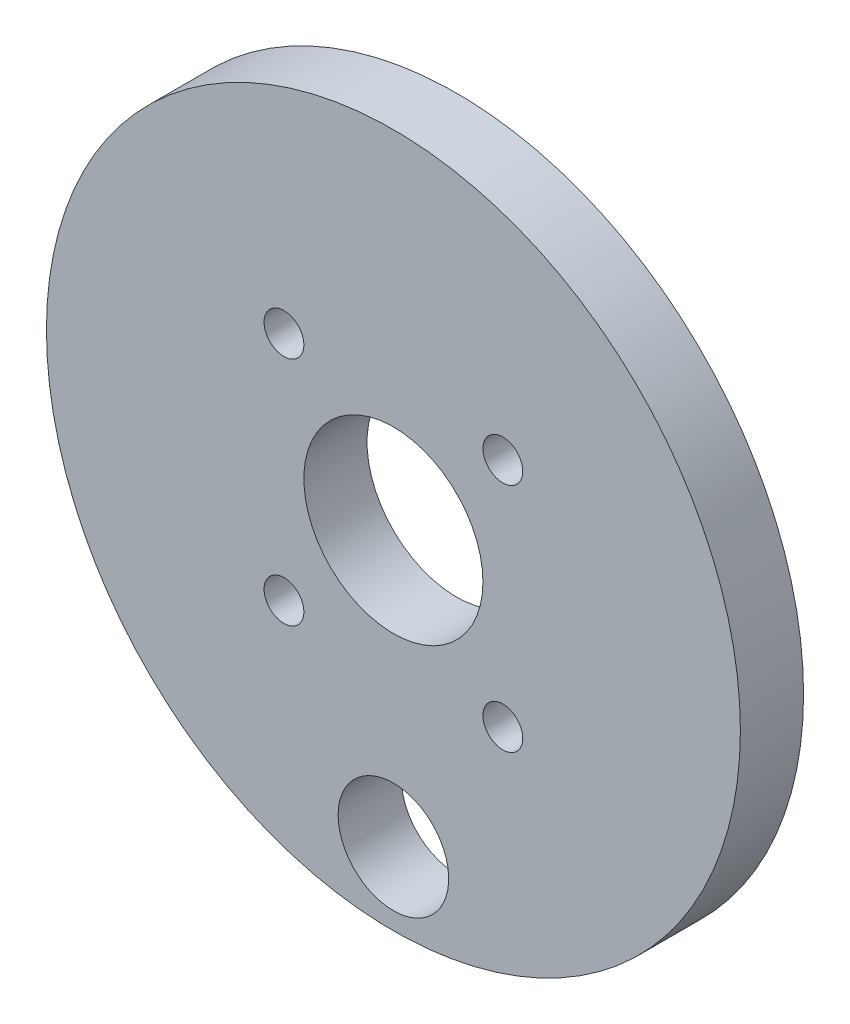
ISO-10303-21;
HEADER;
FILE_DESCRIPTION(('STEP AP214'),'2;1');
FILE_NAME('part.step','',(''),(''),'','','');
FILE_SCHEMA(('AUTOMOTIVE_DESIGN { 1 0 10303 214 1 1 1 1 }'));
ENDSEC;
DATA;
#1=APPLICATION_CONTEXT('core data for automotive mechanical design processes');
#2=APPLICATION_PROTOCOL_DEFINITION('international standard','automotive_design',2000,#1);
#3=PRODUCT_CONTEXT('',#1,'mechanical');
#4=PRODUCT('Part','Part','',(#3));
#5=PRODUCT_RELATED_PRODUCT_CATEGORY('part','',(#4));
#6=PRODUCT_DEFINITION_FORMATION('','',#4);
#7=PRODUCT_DEFINITION_CONTEXT('part definition',#1,'design');
#8=PRODUCT_DEFINITION('design','',#6,#7);
#9=PRODUCT_DEFINITION_SHAPE('','',#8);
#10=(LENGTH_UNIT() NAMED_UNIT(*) SI_UNIT(.MILLI.,.METRE.));
#11=(NAMED_UNIT(*) PLANE_ANGLE_UNIT() SI_UNIT($,.RADIAN.));
#12=(NAMED_UNIT(*) SI_UNIT($,.STERADIAN.) SOLID_ANGLE_UNIT());
#13=UNCERTAINTY_MEASURE_WITH_UNIT(LENGTH_MEASURE(1.E-05),#10,'distance_accuracy_value','');
#14=(GEOMETRIC_REPRESENTATION_CONTEXT(3) GLOBAL_UNCERTAINTY_ASSIGNED_CONTEXT((#13)) GLOBAL_UNIT_ASSIGNED_CONTEXT((#10,
#11,#12)) REPRESENTATION_CONTEXT('',''));
#15=CARTESIAN_POINT('',(0.,0.,0.));
#16=DIRECTION('',(0.,0.,1.));
#17=DIRECTION('',(1.,0.,0.));
#18=AXIS2_PLACEMENT_3D('',#15,#16,#17);
#19=CARTESIAN_POINT('',(0.,0.,6.35));
#20=DIRECTION('',(0.,0.,1.));
#21=DIRECTION('',(1.,0.,0.));
#22=AXIS2_PLACEMENT_3D('',#19,#20,#21);
#23=PLANE('',#22);
#24=CARTESIAN_POINT('',(0.,-27.5594408880053,6.35));
#25=DIRECTION('',(0.,0.,-1.));
#26=DIRECTION('',(-1.,0.,0.));
#27=AXIS2_PLACEMENT_3D('',#24,#25,#26);
#28=CIRCLE('',#27,5.55625);
#29=CARTESIAN_POINT('',(-5.55625,-27.5594408880053,6.35));
#30=VERTEX_POINT('',#29);
#31=EDGE_CURVE('E73',#30,#30,#28,.T.);
#32=ORIENTED_EDGE('',*,*,#31,.T.);
#33=EDGE_LOOP('',(#32));
#34=FACE_BOUND('',#33,.T.);
#35=CARTESIAN_POINT('',(11.0000000000004,-11.6189500386224,6.35));
#36=DIRECTION('',(0.,0.,-1.));
#37=DIRECTION('',(-1.,0.,0.));
#38=AXIS2_PLACEMENT_3D('',#35,#36,#37);
#39=CIRCLE('',#38,2.);
#40=CARTESIAN_POINT('',(9.00000000000039,-11.6189500386224,6.35));
#41=VERTEX_POINT('',#40);
#42=EDGE_CURVE('E67',#41,#41,#39,.T.);
#43=ORIENTED_EDGE('',*,*,#42,.T.);
#44=EDGE_LOOP('',(#43));
#45=FACE_BOUND('',#44,.T.);
#46=CARTESIAN_POINT('',(-10.9999999999996,-11.6189500386224,6.35));
#47=DIRECTION('',(0.,0.,-1.));
#48=DIRECTION('',(-1.,0.,0.));
#49=AXIS2_PLACEMENT_3D('',#46,#47,#48);
#50=CIRCLE('',#49,2.);
#51=CARTESIAN_POINT('',(-12.9999999999996,-11.6189500386224,6.35));
#52=VERTEX_POINT('',#51);
#53=EDGE_CURVE('E61',#52,#52,#50,.T.);
#54=ORIENTED_EDGE('',*,*,#53,.T.);
#55=EDGE_LOOP('',(#54));
#56=FACE_BOUND('',#55,.T.);
#57=CARTESIAN_POINT('',(-10.9999999999996,11.6189500386222,6.35));
#58=DIRECTION('',(0.,0.,-1.));
#59=DIRECTION('',(-1.,0.,0.));
#60=AXIS2_PLACEMENT_3D('',#57,#58,#59);
#61=CIRCLE('',#60,2.);
#62=CARTESIAN_POINT('',(-12.9999999999996,11.6189500386222,6.35));
#63=VERTEX_POINT('',#62);
#64=EDGE_CURVE('E55',#63,#63,#61,.T.);
#65=ORIENTED_EDGE('',*,*,#64,.T.);
#66=EDGE_LOOP('',(#65));
#67=FACE_BOUND('',#66,.T.);
#68=CARTESIAN_POINT('',(11.0000000000004,11.6189500386222,6.35));
#69=DIRECTION('',(0.,0.,-1.));
#70=DIRECTION('',(-1.,0.,0.));
#71=AXIS2_PLACEMENT_3D('',#68,#69,#70);
#72=CIRCLE('',#71,2.);
#73=CARTESIAN_POINT('',(9.00000000000044,11.6189500386222,6.35));
#74=VERTEX_POINT('',#73);
#75=EDGE_CURVE('E49',#74,#74,#72,.T.);
#76=ORIENTED_EDGE('',*,*,#75,.T.);
#77=EDGE_LOOP('',(#76));
#78=FACE_BOUND('',#77,.T.);
#79=CARTESIAN_POINT('',(0.,0.,6.35));
#80=DIRECTION('',(0.,0.,1.));
#81=DIRECTION('',(1.,0.,0.));
#82=AXIS2_PLACEMENT_3D('',#79,#80,#81);
#83=CIRCLE('',#82,34.875);
#84=CARTESIAN_POINT('',(34.875,0.,6.35));
#85=VERTEX_POINT('',#84);
#86=EDGE_CURVE('E10',#85,#85,#83,.T.);
#87=ORIENTED_EDGE('',*,*,#86,.T.);
#88=EDGE_LOOP('',(#87));
#89=FACE_BOUND('',#88,.T.);
#90=CARTESIAN_POINT('',(0.,0.,6.35));
#91=DIRECTION('',(0.,0.,1.));
#92=DIRECTION('',(1.,0.,0.));
#93=AXIS2_PLACEMENT_3D('',#90,#91,#92);
#94=CIRCLE('',#93,9.);
#95=CARTESIAN_POINT('',(9.,0.,6.35));
#96=VERTEX_POINT('',#95);
#97=EDGE_CURVE('E44',#96,#96,#94,.T.);
#98=ORIENTED_EDGE('',*,*,#97,.F.);
#99=EDGE_LOOP('',(#98));
#100=FACE_BOUND('',#99,.T.);
#101=ADVANCED_FACE('F33',(#34,#45,#56,#67,#78,#89,#100),#23,.T.);
#102=CARTESIAN_POINT('',(0.,0.,0.));
#103=DIRECTION('',(0.,0.,1.));
#104=DIRECTION('',(1.,0.,0.));
#105=AXIS2_PLACEMENT_3D('',#102,#103,#104);
#106=PLANE('',#105);
#107=CARTESIAN_POINT('',(0.,-27.5594408880053,0.));
#108=DIRECTION('',(0.,0.,-1.));
#109=DIRECTION('',(-1.,0.,0.));
#110=AXIS2_PLACEMENT_3D('',#107,#108,#109);
#111=CIRCLE('',#110,5.55625);
#112=CARTESIAN_POINT('',(-5.55625,-27.5594408880053,0.));
#113=VERTEX_POINT('',#112);
#114=EDGE_CURVE('E76',#113,#113,#111,.T.);
#115=ORIENTED_EDGE('',*,*,#114,.F.);
#116=EDGE_LOOP('',(#115));
#117=FACE_BOUND('',#116,.T.);
#118=CARTESIAN_POINT('',(11.0000000000004,-11.6189500386224,0.));
#119=DIRECTION('',(0.,0.,-1.));
#120=DIRECTION('',(-1.,0.,0.));
#121=AXIS2_PLACEMENT_3D('',#118,#119,#120);
#122=CIRCLE('',#121,2.);
#123=CARTESIAN_POINT('',(9.00000000000039,-11.6189500386224,0.));
#124=VERTEX_POINT('',#123);
#125=EDGE_CURVE('E70',#124,#124,#122,.T.);
#126=ORIENTED_EDGE('',*,*,#125,.F.);
#127=EDGE_LOOP('',(#126));
#128=FACE_BOUND('',#127,.T.);
#129=CARTESIAN_POINT('',(-10.9999999999996,-11.6189500386224,0.));
#130=DIRECTION('',(0.,0.,-1.));
#131=DIRECTION('',(-1.,0.,0.));
#132=AXIS2_PLACEMENT_3D('',#129,#130,#131);
#133=CIRCLE('',#132,2.);
#134=CARTESIAN_POINT('',(-12.9999999999996,-11.6189500386224,0.));
#135=VERTEX_POINT('',#134);
#136=EDGE_CURVE('E64',#135,#135,#133,.T.);
#137=ORIENTED_EDGE('',*,*,#136,.F.);
#138=EDGE_LOOP('',(#137));
#139=FACE_BOUND('',#138,.T.);
#140=CARTESIAN_POINT('',(-10.9999999999996,11.6189500386222,0.));
#141=DIRECTION('',(0.,0.,-1.));
#142=DIRECTION('',(-1.,0.,0.));
#143=AXIS2_PLACEMENT_3D('',#140,#141,#142);
#144=CIRCLE('',#143,2.);
#145=CARTESIAN_POINT('',(-12.9999999999996,11.6189500386222,0.));
#146=VERTEX_POINT('',#145);
#147=EDGE_CURVE('E58',#146,#146,#144,.T.);
#148=ORIENTED_EDGE('',*,*,#147,.F.);
#149=EDGE_LOOP('',(#148));
#150=FACE_BOUND('',#149,.T.);
#151=CARTESIAN_POINT('',(11.0000000000004,11.6189500386222,0.));
#152=DIRECTION('',(0.,0.,-1.));
#153=DIRECTION('',(-1.,0.,0.));
#154=AXIS2_PLACEMENT_3D('',#151,#152,#153);
#155=CIRCLE('',#154,2.);
#156=CARTESIAN_POINT('',(9.00000000000044,11.6189500386222,0.));
#157=VERTEX_POINT('',#156);
#158=EDGE_CURVE('E52',#157,#157,#155,.T.);
#159=ORIENTED_EDGE('',*,*,#158,.F.);
#160=EDGE_LOOP('',(#159));
#161=FACE_BOUND('',#160,.T.);
#162=CARTESIAN_POINT('',(0.,0.,0.));
#163=DIRECTION('',(0.,0.,1.));
#164=DIRECTION('',(1.,0.,0.));
#165=AXIS2_PLACEMENT_3D('',#162,#163,#164);
#166=CIRCLE('',#165,34.875);
#167=CARTESIAN_POINT('',(34.875,0.,0.));
#168=VERTEX_POINT('',#167);
#169=EDGE_CURVE('E37',#168,#168,#166,.T.);
#170=ORIENTED_EDGE('',*,*,#169,.F.);
#171=EDGE_LOOP('',(#170));
#172=FACE_BOUND('',#171,.T.);
#173=CARTESIAN_POINT('',(0.,0.,0.));
#174=DIRECTION('',(0.,0.,1.));
#175=DIRECTION('',(1.,0.,0.));
#176=AXIS2_PLACEMENT_3D('',#173,#174,#175);
#177=CIRCLE('',#176,9.);
#178=CARTESIAN_POINT('',(9.,0.,0.));
#179=VERTEX_POINT('',#178);
#180=EDGE_CURVE('E46',#179,#179,#177,.T.);
#181=ORIENTED_EDGE('',*,*,#180,.T.);
#182=EDGE_LOOP('',(#181));
#183=FACE_BOUND('',#182,.T.);
#184=ADVANCED_FACE('F91',(#117,#128,#139,#150,#161,#172,#183),#106,.F.);
#185=CARTESIAN_POINT('',(0.,0.,6.35));
#186=DIRECTION('',(0.,0.,-1.));
#187=DIRECTION('',(-1.,0.,0.));
#188=AXIS2_PLACEMENT_3D('',#185,#186,#187);
#189=CYLINDRICAL_SURFACE('',#188,34.875);
#190=ORIENTED_EDGE('',*,*,#86,.F.);
#191=EDGE_LOOP('',(#190));
#192=FACE_BOUND('',#191,.T.);
#193=ORIENTED_EDGE('',*,*,#169,.T.);
#194=EDGE_LOOP('',(#193));
#195=FACE_BOUND('',#194,.T.);
#196=ADVANCED_FACE('F35',(#192,#195),#189,.T.);
#197=CARTESIAN_POINT('',(0.,0.,6.35));
#198=DIRECTION('',(0.,0.,-1.));
#199=DIRECTION('',(-1.,0.,0.));
#200=AXIS2_PLACEMENT_3D('',#197,#198,#199);
#201=CYLINDRICAL_SURFACE('',#200,9.);
#202=ORIENTED_EDGE('',*,*,#97,.T.);
#203=EDGE_LOOP('',(#202));
#204=FACE_BOUND('',#203,.T.);
#205=ORIENTED_EDGE('',*,*,#180,.F.);
#206=EDGE_LOOP('',(#205));
#207=FACE_BOUND('',#206,.T.);
#208=ADVANCED_FACE('F106',(#204,#207),#201,.F.);
#209=CARTESIAN_POINT('',(11.0000000000004,11.6189500386222,6.35));
#210=DIRECTION('',(0.,0.,-1.));
#211=DIRECTION('',(-1.,0.,0.));
#212=AXIS2_PLACEMENT_3D('',#209,#210,#211);
#213=CYLINDRICAL_SURFACE('',#212,2.);
#214=ORIENTED_EDGE('',*,*,#75,.F.);
#215=EDGE_LOOP('',(#214));
#216=FACE_BOUND('',#215,.T.);
#217=ORIENTED_EDGE('',*,*,#158,.T.);
#218=EDGE_LOOP('',(#217));
#219=FACE_BOUND('',#218,.T.);
#220=ADVANCED_FACE('F108',(#216,#219),#213,.F.);
#221=CARTESIAN_POINT('',(-10.9999999999996,11.6189500386222,6.35));
#222=DIRECTION('',(0.,0.,-1.));
#223=DIRECTION('',(-1.,0.,0.));
#224=AXIS2_PLACEMENT_3D('',#221,#222,#223);
#225=CYLINDRICAL_SURFACE('',#224,2.);
#226=ORIENTED_EDGE('',*,*,#64,.F.);
#227=EDGE_LOOP('',(#226));
#228=FACE_BOUND('',#227,.T.);
#229=ORIENTED_EDGE('',*,*,#147,.T.);
#230=EDGE_LOOP('',(#229));
#231=FACE_BOUND('',#230,.T.);
#232=ADVANCED_FACE('F115',(#228,#231),#225,.F.);
#233=CARTESIAN_POINT('',(-10.9999999999996,-11.6189500386224,6.35));
#234=DIRECTION('',(0.,0.,-1.));
#235=DIRECTION('',(-1.,0.,0.));
#236=AXIS2_PLACEMENT_3D('',#233,#234,#235);
#237=CYLINDRICAL_SURFACE('',#236,2.);
#238=ORIENTED_EDGE('',*,*,#53,.F.);
#239=EDGE_LOOP('',(#238));
#240=FACE_BOUND('',#239,.T.);
#241=ORIENTED_EDGE('',*,*,#136,.T.);
#242=EDGE_LOOP('',(#241));
#243=FACE_BOUND('',#242,.T.);
#244=ADVANCED_FACE('F152',(#240,#243),#237,.F.);
#245=CARTESIAN_POINT('',(11.0000000000004,-11.6189500386224,6.35));
#246=DIRECTION('',(0.,0.,-1.));
#247=DIRECTION('',(-1.,0.,0.));
#248=AXIS2_PLACEMENT_3D('',#245,#246,#247);
#249=CYLINDRICAL_SURFACE('',#248,2.);
#250=ORIENTED_EDGE('',*,*,#42,.F.);
#251=EDGE_LOOP('',(#250));
#252=FACE_BOUND('',#251,.T.);
#253=ORIENTED_EDGE('',*,*,#125,.T.);
#254=EDGE_LOOP('',(#253));
#255=FACE_BOUND('',#254,.T.);
#256=ADVANCED_FACE('F87',(#252,#255),#249,.F.);
#257=CARTESIAN_POINT('',(0.,-27.5594408880053,6.35));
#258=DIRECTION('',(0.,0.,-1.));
#259=DIRECTION('',(-1.,0.,0.));
#260=AXIS2_PLACEMENT_3D('',#257,#258,#259);
#261=CYLINDRICAL_SURFACE('',#260,5.55625);
#262=ORIENTED_EDGE('',*,*,#31,.F.);
#263=EDGE_LOOP('',(#262));
#264=FACE_BOUND('',#263,.T.);
#265=ORIENTED_EDGE('',*,*,#114,.T.);
#266=EDGE_LOOP('',(#265));
#267=FACE_BOUND('',#266,.T.);
#268=ADVANCED_FACE('F84',(#264,#267),#261,.F.);
#269=CLOSED_SHELL('',(#101,#184,#196,#208,#220,#232,#244,#256,#268));
#270=MANIFOLD_SOLID_BREP('B2',#269);
#271=ADVANCED_BREP_SHAPE_REPRESENTATION('',(#18,#270),#14);
#272=SHAPE_DEFINITION_REPRESENTATION(#9,#271);
ENDSEC;
END-ISO-10303-21;
